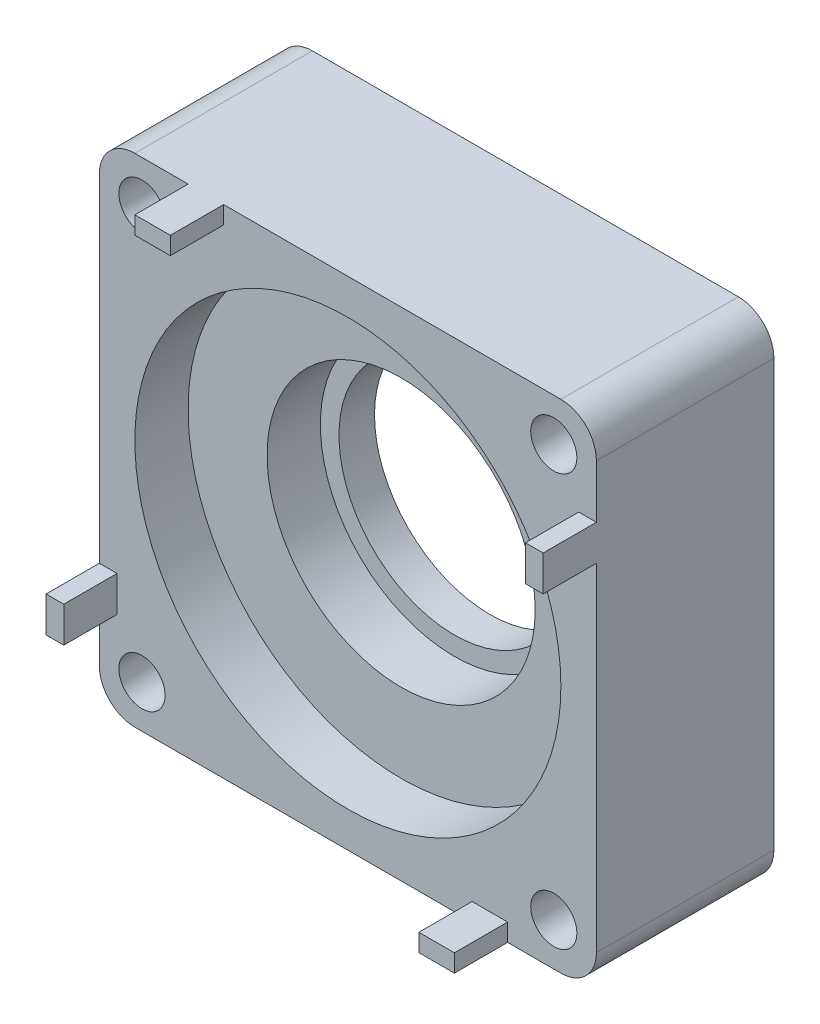
ISO-10303-21;
HEADER;
FILE_DESCRIPTION(('STEP AP214'),'2;1');
FILE_NAME('part.step','',(''),(''),'','','');
FILE_SCHEMA(('AUTOMOTIVE_DESIGN { 1 0 10303 214 1 1 1 1 }'));
ENDSEC;
DATA;
#1=APPLICATION_CONTEXT('core data for automotive mechanical design processes');
#2=APPLICATION_PROTOCOL_DEFINITION('international standard','automotive_design',2000,#1);
#3=PRODUCT_CONTEXT('',#1,'mechanical');
#4=PRODUCT('Part','Part','',(#3));
#5=PRODUCT_RELATED_PRODUCT_CATEGORY('part','',(#4));
#6=PRODUCT_DEFINITION_FORMATION('','',#4);
#7=PRODUCT_DEFINITION_CONTEXT('part definition',#1,'design');
#8=PRODUCT_DEFINITION('design','',#6,#7);
#9=PRODUCT_DEFINITION_SHAPE('','',#8);
#10=(LENGTH_UNIT() NAMED_UNIT(*) SI_UNIT(.MILLI.,.METRE.));
#11=(NAMED_UNIT(*) PLANE_ANGLE_UNIT() SI_UNIT($,.RADIAN.));
#12=(NAMED_UNIT(*) SI_UNIT($,.STERADIAN.) SOLID_ANGLE_UNIT());
#13=UNCERTAINTY_MEASURE_WITH_UNIT(LENGTH_MEASURE(1.E-05),#10,'distance_accuracy_value','');
#14=(GEOMETRIC_REPRESENTATION_CONTEXT(3) GLOBAL_UNCERTAINTY_ASSIGNED_CONTEXT((#13)) GLOBAL_UNIT_ASSIGNED_CONTEXT((#10,
#11,#12)) REPRESENTATION_CONTEXT('',''));
#15=CARTESIAN_POINT('',(0.,0.,0.));
#16=DIRECTION('',(0.,0.,1.));
#17=DIRECTION('',(1.,0.,0.));
#18=AXIS2_PLACEMENT_3D('',#15,#16,#17);
#19=CARTESIAN_POINT('',(0.,0.,-21.3546247918337));
#20=DIRECTION('',(0.,0.,1.));
#21=DIRECTION('',(1.,0.,0.));
#22=AXIS2_PLACEMENT_3D('',#19,#20,#21);
#23=CYLINDRICAL_SURFACE('',#22,7.55);
#24=CARTESIAN_POINT('',(0.,0.,4.));
#25=DIRECTION('',(0.,0.,1.));
#26=DIRECTION('',(1.,0.,0.));
#27=AXIS2_PLACEMENT_3D('',#24,#25,#26);
#28=CIRCLE('',#27,7.55);
#29=CARTESIAN_POINT('',(7.55,0.,4.));
#30=VERTEX_POINT('',#29);
#31=EDGE_CURVE('E325',#30,#30,#28,.F.);
#32=ORIENTED_EDGE('',*,*,#31,.T.);
#33=EDGE_LOOP('',(#32));
#34=FACE_BOUND('',#33,.T.);
#35=CARTESIAN_POINT('',(0.,0.,7.));
#36=DIRECTION('',(0.,0.,1.));
#37=DIRECTION('',(1.,0.,0.));
#38=AXIS2_PLACEMENT_3D('',#35,#36,#37);
#39=CIRCLE('',#38,7.55);
#40=CARTESIAN_POINT('',(7.55,0.,7.));
#41=VERTEX_POINT('',#40);
#42=EDGE_CURVE('E46',#41,#41,#39,.F.);
#43=ORIENTED_EDGE('',*,*,#42,.F.);
#44=EDGE_LOOP('',(#43));
#45=FACE_BOUND('',#44,.T.);
#46=ADVANCED_FACE('F42',(#34,#45),#23,.F.);
#47=CARTESIAN_POINT('',(0.,0.,10.));
#48=DIRECTION('',(0.,0.,1.));
#49=DIRECTION('',(1.,0.,0.));
#50=AXIS2_PLACEMENT_3D('',#47,#48,#49);
#51=PLANE('',#50);
#52=CARTESIAN_POINT('',(11.5999999999993,-11.6,10.));
#53=DIRECTION('',(0.,0.,1.));
#54=DIRECTION('',(1.,0.,0.));
#55=AXIS2_PLACEMENT_3D('',#52,#53,#54);
#56=CIRCLE('',#55,1.30000000000034);
#57=CARTESIAN_POINT('',(12.8999999999997,-11.6,10.));
#58=VERTEX_POINT('',#57);
#59=EDGE_CURVE('E420',#58,#58,#56,.T.);
#60=ORIENTED_EDGE('',*,*,#59,.F.);
#61=EDGE_LOOP('',(#60));
#62=FACE_BOUND('',#61,.T.);
#63=CARTESIAN_POINT('',(-11.6000000000007,-11.5999999999993,10.));
#64=DIRECTION('',(0.,0.,1.));
#65=DIRECTION('',(1.,0.,0.));
#66=AXIS2_PLACEMENT_3D('',#63,#64,#65);
#67=CIRCLE('',#66,1.30000000000092);
#68=CARTESIAN_POINT('',(-10.2999999999997,-11.5999999999993,10.));
#69=VERTEX_POINT('',#68);
#70=EDGE_CURVE('E423',#69,#69,#67,.T.);
#71=ORIENTED_EDGE('',*,*,#70,.F.);
#72=EDGE_LOOP('',(#71));
#73=FACE_BOUND('',#72,.T.);
#74=CARTESIAN_POINT('',(-11.6,11.6000000000007,10.));
#75=DIRECTION('',(0.,0.,1.));
#76=DIRECTION('',(1.,0.,0.));
#77=AXIS2_PLACEMENT_3D('',#74,#75,#76);
#78=CIRCLE('',#77,1.30000000000068);
#79=CARTESIAN_POINT('',(-10.2999999999993,11.6000000000007,10.));
#80=VERTEX_POINT('',#79);
#81=EDGE_CURVE('E426',#80,#80,#78,.T.);
#82=ORIENTED_EDGE('',*,*,#81,.F.);
#83=EDGE_LOOP('',(#82));
#84=FACE_BOUND('',#83,.T.);
#85=CARTESIAN_POINT('',(11.6,11.6,10.));
#86=DIRECTION('',(0.,0.,1.));
#87=DIRECTION('',(1.,0.,0.));
#88=AXIS2_PLACEMENT_3D('',#85,#86,#87);
#89=CIRCLE('',#88,1.3);
#90=CARTESIAN_POINT('',(12.9,11.6,10.));
#91=VERTEX_POINT('',#90);
#92=EDGE_CURVE('E429',#91,#91,#89,.T.);
#93=ORIENTED_EDGE('',*,*,#92,.F.);
#94=EDGE_LOOP('',(#93));
#95=FACE_BOUND('',#94,.T.);
#96=CARTESIAN_POINT('',(0.,0.,10.));
#97=DIRECTION('',(0.,0.,1.));
#98=DIRECTION('',(1.,0.,0.));
#99=AXIS2_PLACEMENT_3D('',#96,#97,#98);
#100=CIRCLE('',#99,12.);
#101=CARTESIAN_POINT('',(12.,0.,10.));
#102=VERTEX_POINT('',#101);
#103=EDGE_CURVE('E417',#102,#102,#100,.T.);
#104=ORIENTED_EDGE('',*,*,#103,.F.);
#105=EDGE_LOOP('',(#104));
#106=FACE_BOUND('',#105,.T.);
#107=DIRECTION('',(-1.,0.,0.));
#108=VECTOR('',#107,1.);
#109=CARTESIAN_POINT('',(6.99999999999986,-13.0046707835646,10.));
#110=LINE('',#109,#108);
#111=CARTESIAN_POINT('',(8.99999999999986,-13.0046707835646,10.));
#112=VERTEX_POINT('',#111);
#113=CARTESIAN_POINT('',(6.99999999999986,-13.0046707835646,10.));
#114=VERTEX_POINT('',#113);
#115=EDGE_CURVE('E58',#112,#114,#110,.T.);
#116=ORIENTED_EDGE('',*,*,#115,.F.);
#117=DIRECTION('',(0.,1.,0.));
#118=VECTOR('',#117,1.);
#119=CARTESIAN_POINT('',(8.99999999999985,-14.0000000000001,10.));
#120=LINE('',#119,#118);
#121=CARTESIAN_POINT('',(8.99999999999985,-14.0000000000001,10.));
#122=VERTEX_POINT('',#121);
#123=EDGE_CURVE('E411',#122,#112,#120,.T.);
#124=ORIENTED_EDGE('',*,*,#123,.F.);
#125=DIRECTION('',(1.,0.,0.));
#126=VECTOR('',#125,1.);
#127=CARTESIAN_POINT('',(-14.,-14.,10.));
#128=LINE('',#127,#126);
#129=CARTESIAN_POINT('',(12.,-14.,10.));
#130=VERTEX_POINT('',#129);
#131=EDGE_CURVE('E226',#122,#130,#128,.T.);
#132=ORIENTED_EDGE('',*,*,#131,.T.);
#133=CARTESIAN_POINT('',(12.,-12.,10.));
#134=DIRECTION('',(0.,0.,1.));
#135=DIRECTION('',(1.,0.,0.));
#136=AXIS2_PLACEMENT_3D('',#133,#134,#135);
#137=CIRCLE('',#136,2.);
#138=CARTESIAN_POINT('',(14.,-12.,10.));
#139=VERTEX_POINT('',#138);
#140=EDGE_CURVE('E381',#130,#139,#137,.T.);
#141=ORIENTED_EDGE('',*,*,#140,.T.);
#142=DIRECTION('',(0.,1.,0.));
#143=VECTOR('',#142,1.);
#144=CARTESIAN_POINT('',(14.,14.,10.));
#145=LINE('',#144,#143);
#146=CARTESIAN_POINT('',(14.,7.,10.));
#147=VERTEX_POINT('',#146);
#148=EDGE_CURVE('E329',#139,#147,#145,.T.);
#149=ORIENTED_EDGE('',*,*,#148,.T.);
#150=DIRECTION('',(1.,0.,0.));
#151=VECTOR('',#150,1.);
#152=CARTESIAN_POINT('',(14.,7.,10.));
#153=LINE('',#152,#151);
#154=CARTESIAN_POINT('',(13.0046707835645,7.,10.));
#155=VERTEX_POINT('',#154);
#156=EDGE_CURVE('E240',#155,#147,#153,.T.);
#157=ORIENTED_EDGE('',*,*,#156,.F.);
#158=DIRECTION('',(0.,-1.,0.));
#159=VECTOR('',#158,1.);
#160=CARTESIAN_POINT('',(13.0046707835645,7.,10.));
#161=LINE('',#160,#159);
#162=CARTESIAN_POINT('',(13.0046707835645,9.,10.));
#163=VERTEX_POINT('',#162);
#164=EDGE_CURVE('E230',#163,#155,#161,.T.);
#165=ORIENTED_EDGE('',*,*,#164,.F.);
#166=DIRECTION('',(-1.,0.,0.));
#167=VECTOR('',#166,1.);
#168=CARTESIAN_POINT('',(14.,9.,10.));
#169=LINE('',#168,#167);
#170=CARTESIAN_POINT('',(14.,9.,10.));
#171=VERTEX_POINT('',#170);
#172=EDGE_CURVE('E227',#171,#163,#169,.T.);
#173=ORIENTED_EDGE('',*,*,#172,.F.);
#174=CARTESIAN_POINT('',(14.,12.,10.));
#175=VERTEX_POINT('',#174);
#176=EDGE_CURVE('E332',#171,#175,#145,.T.);
#177=ORIENTED_EDGE('',*,*,#176,.T.);
#178=CARTESIAN_POINT('',(12.,12.,10.));
#179=DIRECTION('',(0.,0.,1.));
#180=DIRECTION('',(1.,0.,0.));
#181=AXIS2_PLACEMENT_3D('',#178,#179,#180);
#182=CIRCLE('',#181,2.);
#183=CARTESIAN_POINT('',(12.,14.,10.));
#184=VERTEX_POINT('',#183);
#185=EDGE_CURVE('E379',#175,#184,#182,.T.);
#186=ORIENTED_EDGE('',*,*,#185,.T.);
#187=DIRECTION('',(-1.,0.,0.));
#188=VECTOR('',#187,1.);
#189=CARTESIAN_POINT('',(-14.,14.,10.));
#190=LINE('',#189,#188);
#191=CARTESIAN_POINT('',(-6.99999999999995,14.,10.));
#192=VERTEX_POINT('',#191);
#193=EDGE_CURVE('E333',#184,#192,#190,.T.);
#194=ORIENTED_EDGE('',*,*,#193,.T.);
#195=DIRECTION('',(0.,1.,0.));
#196=VECTOR('',#195,1.);
#197=CARTESIAN_POINT('',(-6.99999999999995,14.,10.));
#198=LINE('',#197,#196);
#199=CARTESIAN_POINT('',(-6.99999999999996,13.0046707835646,10.));
#200=VERTEX_POINT('',#199);
#201=EDGE_CURVE('E267',#200,#192,#198,.T.);
#202=ORIENTED_EDGE('',*,*,#201,.F.);
#203=DIRECTION('',(1.,0.,0.));
#204=VECTOR('',#203,1.);
#205=CARTESIAN_POINT('',(-6.99999999999996,13.0046707835646,10.));
#206=LINE('',#205,#204);
#207=CARTESIAN_POINT('',(-8.99999999999995,13.0046707835646,10.));
#208=VERTEX_POINT('',#207);
#209=EDGE_CURVE('E275',#208,#200,#206,.T.);
#210=ORIENTED_EDGE('',*,*,#209,.F.);
#211=DIRECTION('',(0.,-1.,0.));
#212=VECTOR('',#211,1.);
#213=CARTESIAN_POINT('',(-8.99999999999995,14.,10.));
#214=LINE('',#213,#212);
#215=CARTESIAN_POINT('',(-8.99999999999995,14.,10.));
#216=VERTEX_POINT('',#215);
#217=EDGE_CURVE('E262',#216,#208,#214,.T.);
#218=ORIENTED_EDGE('',*,*,#217,.F.);
#219=CARTESIAN_POINT('',(-12.,14.,10.));
#220=VERTEX_POINT('',#219);
#221=EDGE_CURVE('E331',#216,#220,#190,.T.);
#222=ORIENTED_EDGE('',*,*,#221,.T.);
#223=CARTESIAN_POINT('',(-12.,12.,10.));
#224=DIRECTION('',(0.,0.,1.));
#225=DIRECTION('',(1.,0.,0.));
#226=AXIS2_PLACEMENT_3D('',#223,#224,#225);
#227=CIRCLE('',#226,2.);
#228=CARTESIAN_POINT('',(-14.,12.,10.));
#229=VERTEX_POINT('',#228);
#230=EDGE_CURVE('E377',#220,#229,#227,.T.);
#231=ORIENTED_EDGE('',*,*,#230,.T.);
#232=DIRECTION('',(0.,-1.,0.));
#233=VECTOR('',#232,1.);
#234=CARTESIAN_POINT('',(-14.,14.,10.));
#235=LINE('',#234,#233);
#236=CARTESIAN_POINT('',(-14.,-7.,10.));
#237=VERTEX_POINT('',#236);
#238=EDGE_CURVE('E337',#229,#237,#235,.T.);
#239=ORIENTED_EDGE('',*,*,#238,.T.);
#240=DIRECTION('',(-1.,0.,0.));
#241=VECTOR('',#240,1.);
#242=CARTESIAN_POINT('',(-14.,-7.,10.));
#243=LINE('',#242,#241);
#244=CARTESIAN_POINT('',(-13.0046707835645,-7.,10.));
#245=VERTEX_POINT('',#244);
#246=EDGE_CURVE('E293',#245,#237,#243,.T.);
#247=ORIENTED_EDGE('',*,*,#246,.F.);
#248=DIRECTION('',(0.,1.,0.));
#249=VECTOR('',#248,1.);
#250=CARTESIAN_POINT('',(-13.0046707835645,-7.,10.));
#251=LINE('',#250,#249);
#252=CARTESIAN_POINT('',(-13.0046707835645,-9.,10.));
#253=VERTEX_POINT('',#252);
#254=EDGE_CURVE('E302',#253,#245,#251,.T.);
#255=ORIENTED_EDGE('',*,*,#254,.F.);
#256=DIRECTION('',(1.,0.,0.));
#257=VECTOR('',#256,1.);
#258=CARTESIAN_POINT('',(-14.,-9.,10.));
#259=LINE('',#258,#257);
#260=CARTESIAN_POINT('',(-14.,-9.,10.));
#261=VERTEX_POINT('',#260);
#262=EDGE_CURVE('E288',#261,#253,#259,.T.);
#263=ORIENTED_EDGE('',*,*,#262,.F.);
#264=CARTESIAN_POINT('',(-14.,-12.,10.));
#265=VERTEX_POINT('',#264);
#266=EDGE_CURVE('E336',#261,#265,#235,.T.);
#267=ORIENTED_EDGE('',*,*,#266,.T.);
#268=CARTESIAN_POINT('',(-12.,-12.,10.));
#269=DIRECTION('',(0.,0.,1.));
#270=DIRECTION('',(1.,0.,0.));
#271=AXIS2_PLACEMENT_3D('',#268,#269,#270);
#272=CIRCLE('',#271,2.);
#273=CARTESIAN_POINT('',(-12.,-14.,10.));
#274=VERTEX_POINT('',#273);
#275=EDGE_CURVE('E375',#265,#274,#272,.T.);
#276=ORIENTED_EDGE('',*,*,#275,.T.);
#277=CARTESIAN_POINT('',(6.99999999999986,-14.,10.));
#278=VERTEX_POINT('',#277);
#279=EDGE_CURVE('E339',#274,#278,#128,.T.);
#280=ORIENTED_EDGE('',*,*,#279,.T.);
#281=DIRECTION('',(0.,-1.,0.));
#282=VECTOR('',#281,1.);
#283=CARTESIAN_POINT('',(6.99999999999985,-14.0000000000001,10.));
#284=LINE('',#283,#282);
#285=EDGE_CURVE('E63',#114,#278,#284,.T.);
#286=ORIENTED_EDGE('',*,*,#285,.F.);
#287=EDGE_LOOP('',(#116,#124,#132,#141,#149,#157,#165,#173,#177,#186,#194,#202,#210,#218,#222,
#231,#239,#247,#255,#263,#267,#276,#280,#286));
#288=FACE_BOUND('',#287,.T.);
#289=ADVANCED_FACE('F401',(#62,#73,#84,#95,#106,#288),#51,.T.);
#290=CARTESIAN_POINT('',(0.,0.,0.));
#291=DIRECTION('',(0.,0.,1.));
#292=DIRECTION('',(1.,0.,0.));
#293=AXIS2_PLACEMENT_3D('',#290,#291,#292);
#294=CYLINDRICAL_SURFACE('',#293,6.5);
#295=CARTESIAN_POINT('',(0.,0.,4.));
#296=DIRECTION('',(0.,0.,1.));
#297=DIRECTION('',(1.,0.,0.));
#298=AXIS2_PLACEMENT_3D('',#295,#296,#297);
#299=CIRCLE('',#298,6.5);
#300=CARTESIAN_POINT('',(6.5,0.,4.));
#301=VERTEX_POINT('',#300);
#302=EDGE_CURVE('E328',#301,#301,#299,.F.);
#303=ORIENTED_EDGE('',*,*,#302,.F.);
#304=EDGE_LOOP('',(#303));
#305=FACE_BOUND('',#304,.T.);
#306=CARTESIAN_POINT('',(0.,0.,2.));
#307=DIRECTION('',(0.,0.,-1.));
#308=DIRECTION('',(-1.,0.,0.));
#309=AXIS2_PLACEMENT_3D('',#306,#307,#308);
#310=CIRCLE('',#309,6.5);
#311=CARTESIAN_POINT('',(-6.5,0.,2.));
#312=VERTEX_POINT('',#311);
#313=EDGE_CURVE('E322',#312,#312,#310,.F.);
#314=ORIENTED_EDGE('',*,*,#313,.F.);
#315=EDGE_LOOP('',(#314));
#316=FACE_BOUND('',#315,.T.);
#317=ADVANCED_FACE('F531',(#305,#316),#294,.F.);
#318=CARTESIAN_POINT('',(14.,14.,10.));
#319=DIRECTION('',(-1.,0.,0.));
#320=DIRECTION('',(0.,0.,1.));
#321=AXIS2_PLACEMENT_3D('',#318,#319,#320);
#322=PLANE('',#321);
#323=ORIENTED_EDGE('',*,*,#148,.F.);
#324=DIRECTION('',(0.,0.,-1.));
#325=VECTOR('',#324,1.);
#326=CARTESIAN_POINT('',(14.,-12.,10.));
#327=LINE('',#326,#325);
#328=CARTESIAN_POINT('',(14.,-12.,0.));
#329=VERTEX_POINT('',#328);
#330=EDGE_CURVE('E359',#139,#329,#327,.T.);
#331=ORIENTED_EDGE('',*,*,#330,.T.);
#332=DIRECTION('',(0.,1.,0.));
#333=VECTOR('',#332,1.);
#334=CARTESIAN_POINT('',(14.,14.,0.));
#335=LINE('',#334,#333);
#336=CARTESIAN_POINT('',(14.,12.,0.));
#337=VERTEX_POINT('',#336);
#338=EDGE_CURVE('E342',#329,#337,#335,.T.);
#339=ORIENTED_EDGE('',*,*,#338,.T.);
#340=DIRECTION('',(0.,0.,-1.));
#341=VECTOR('',#340,1.);
#342=CARTESIAN_POINT('',(14.,12.,10.));
#343=LINE('',#342,#341);
#344=EDGE_CURVE('E341',#337,#175,#343,.F.);
#345=ORIENTED_EDGE('',*,*,#344,.T.);
#346=ORIENTED_EDGE('',*,*,#176,.F.);
#347=DIRECTION('',(0.,0.,-1.));
#348=VECTOR('',#347,1.);
#349=CARTESIAN_POINT('',(14.,9.,13.));
#350=LINE('',#349,#348);
#351=CARTESIAN_POINT('',(14.,9.,13.));
#352=VERTEX_POINT('',#351);
#353=EDGE_CURVE('E259',#352,#171,#350,.T.);
#354=ORIENTED_EDGE('',*,*,#353,.F.);
#355=DIRECTION('',(0.,1.,0.));
#356=VECTOR('',#355,1.);
#357=CARTESIAN_POINT('',(14.,7.,13.));
#358=LINE('',#357,#356);
#359=CARTESIAN_POINT('',(14.,7.,13.));
#360=VERTEX_POINT('',#359);
#361=EDGE_CURVE('E236',#360,#352,#358,.T.);
#362=ORIENTED_EDGE('',*,*,#361,.F.);
#363=DIRECTION('',(0.,0.,-1.));
#364=VECTOR('',#363,1.);
#365=CARTESIAN_POINT('',(14.,7.,13.));
#366=LINE('',#365,#364);
#367=EDGE_CURVE('E245',#360,#147,#366,.T.);
#368=ORIENTED_EDGE('',*,*,#367,.T.);
#369=EDGE_LOOP('',(#323,#331,#339,#345,#346,#354,#362,#368));
#370=FACE_BOUND('',#369,.T.);
#371=ADVANCED_FACE('F462',(#370),#322,.F.);
#372=CARTESIAN_POINT('',(-14.,14.,10.));
#373=DIRECTION('',(0.,-1.,0.));
#374=DIRECTION('',(0.,0.,-1.));
#375=AXIS2_PLACEMENT_3D('',#372,#373,#374);
#376=PLANE('',#375);
#377=ORIENTED_EDGE('',*,*,#193,.F.);
#378=DIRECTION('',(0.,0.,-1.));
#379=VECTOR('',#378,1.);
#380=CARTESIAN_POINT('',(12.,14.,10.));
#381=LINE('',#380,#379);
#382=CARTESIAN_POINT('',(12.,14.,0.));
#383=VERTEX_POINT('',#382);
#384=EDGE_CURVE('E386',#184,#383,#381,.T.);
#385=ORIENTED_EDGE('',*,*,#384,.T.);
#386=DIRECTION('',(-1.,0.,0.));
#387=VECTOR('',#386,1.);
#388=CARTESIAN_POINT('',(-14.,14.,0.));
#389=LINE('',#388,#387);
#390=CARTESIAN_POINT('',(-12.,14.,0.));
#391=VERTEX_POINT('',#390);
#392=EDGE_CURVE('E345',#383,#391,#389,.T.);
#393=ORIENTED_EDGE('',*,*,#392,.T.);
#394=DIRECTION('',(0.,0.,-1.));
#395=VECTOR('',#394,1.);
#396=CARTESIAN_POINT('',(-12.,14.,10.));
#397=LINE('',#396,#395);
#398=EDGE_CURVE('E383',#391,#220,#397,.F.);
#399=ORIENTED_EDGE('',*,*,#398,.T.);
#400=ORIENTED_EDGE('',*,*,#221,.F.);
#401=DIRECTION('',(0.,0.,-1.));
#402=VECTOR('',#401,1.);
#403=CARTESIAN_POINT('',(-8.99999999999995,14.,13.));
#404=LINE('',#403,#402);
#405=CARTESIAN_POINT('',(-8.99999999999995,14.,13.));
#406=VERTEX_POINT('',#405);
#407=EDGE_CURVE('E286',#406,#216,#404,.T.);
#408=ORIENTED_EDGE('',*,*,#407,.F.);
#409=DIRECTION('',(-1.,0.,0.));
#410=VECTOR('',#409,1.);
#411=CARTESIAN_POINT('',(-6.99999999999995,14.,13.));
#412=LINE('',#411,#410);
#413=CARTESIAN_POINT('',(-6.99999999999995,14.,13.));
#414=VERTEX_POINT('',#413);
#415=EDGE_CURVE('E263',#414,#406,#412,.T.);
#416=ORIENTED_EDGE('',*,*,#415,.F.);
#417=DIRECTION('',(0.,0.,-1.));
#418=VECTOR('',#417,1.);
#419=CARTESIAN_POINT('',(-6.99999999999995,14.,13.));
#420=LINE('',#419,#418);
#421=EDGE_CURVE('E273',#414,#192,#420,.T.);
#422=ORIENTED_EDGE('',*,*,#421,.T.);
#423=EDGE_LOOP('',(#377,#385,#393,#399,#400,#408,#416,#422));
#424=FACE_BOUND('',#423,.T.);
#425=ADVANCED_FACE('F472',(#424),#376,.F.);
#426=CARTESIAN_POINT('',(-14.,14.,10.));
#427=DIRECTION('',(1.,0.,0.));
#428=DIRECTION('',(0.,0.,-1.));
#429=AXIS2_PLACEMENT_3D('',#426,#427,#428);
#430=PLANE('',#429);
#431=ORIENTED_EDGE('',*,*,#238,.F.);
#432=DIRECTION('',(0.,0.,-1.));
#433=VECTOR('',#432,1.);
#434=CARTESIAN_POINT('',(-14.,12.,10.));
#435=LINE('',#434,#433);
#436=CARTESIAN_POINT('',(-14.,12.,0.));
#437=VERTEX_POINT('',#436);
#438=EDGE_CURVE('E13',#229,#437,#435,.T.);
#439=ORIENTED_EDGE('',*,*,#438,.T.);
#440=DIRECTION('',(0.,-1.,0.));
#441=VECTOR('',#440,1.);
#442=CARTESIAN_POINT('',(-14.,14.,0.));
#443=LINE('',#442,#441);
#444=CARTESIAN_POINT('',(-14.,-12.,0.));
#445=VERTEX_POINT('',#444);
#446=EDGE_CURVE('E348',#437,#445,#443,.T.);
#447=ORIENTED_EDGE('',*,*,#446,.T.);
#448=DIRECTION('',(0.,0.,-1.));
#449=VECTOR('',#448,1.);
#450=CARTESIAN_POINT('',(-14.,-12.,10.));
#451=LINE('',#450,#449);
#452=EDGE_CURVE('E51',#445,#265,#451,.F.);
#453=ORIENTED_EDGE('',*,*,#452,.T.);
#454=ORIENTED_EDGE('',*,*,#266,.F.);
#455=DIRECTION('',(0.,0.,-1.));
#456=VECTOR('',#455,1.);
#457=CARTESIAN_POINT('',(-14.,-9.,13.));
#458=LINE('',#457,#456);
#459=CARTESIAN_POINT('',(-14.,-9.,13.));
#460=VERTEX_POINT('',#459);
#461=EDGE_CURVE('E315',#460,#261,#458,.T.);
#462=ORIENTED_EDGE('',*,*,#461,.F.);
#463=DIRECTION('',(0.,-1.,0.));
#464=VECTOR('',#463,1.);
#465=CARTESIAN_POINT('',(-14.,-7.,13.));
#466=LINE('',#465,#464);
#467=CARTESIAN_POINT('',(-14.,-7.,13.));
#468=VERTEX_POINT('',#467);
#469=EDGE_CURVE('E289',#468,#460,#466,.T.);
#470=ORIENTED_EDGE('',*,*,#469,.F.);
#471=DIRECTION('',(0.,0.,-1.));
#472=VECTOR('',#471,1.);
#473=CARTESIAN_POINT('',(-14.,-7.,13.));
#474=LINE('',#473,#472);
#475=EDGE_CURVE('E299',#468,#237,#474,.T.);
#476=ORIENTED_EDGE('',*,*,#475,.T.);
#477=EDGE_LOOP('',(#431,#439,#447,#453,#454,#462,#470,#476));
#478=FACE_BOUND('',#477,.T.);
#479=ADVANCED_FACE('F395',(#478),#430,.F.);
#480=CARTESIAN_POINT('',(-14.,-14.,10.));
#481=DIRECTION('',(0.,1.,0.));
#482=DIRECTION('',(0.,0.,1.));
#483=AXIS2_PLACEMENT_3D('',#480,#481,#482);
#484=PLANE('',#483);
#485=DIRECTION('',(1.,0.,0.));
#486=VECTOR('',#485,1.);
#487=CARTESIAN_POINT('',(-14.,-14.,0.));
#488=LINE('',#487,#486);
#489=CARTESIAN_POINT('',(-12.,-14.,0.));
#490=VERTEX_POINT('',#489);
#491=CARTESIAN_POINT('',(12.,-14.,0.));
#492=VERTEX_POINT('',#491);
#493=EDGE_CURVE('E351',#490,#492,#488,.T.);
#494=ORIENTED_EDGE('',*,*,#493,.T.);
#495=DIRECTION('',(0.,0.,-1.));
#496=VECTOR('',#495,1.);
#497=CARTESIAN_POINT('',(12.,-14.,10.));
#498=LINE('',#497,#496);
#499=EDGE_CURVE('E373',#492,#130,#498,.F.);
#500=ORIENTED_EDGE('',*,*,#499,.T.);
#501=ORIENTED_EDGE('',*,*,#131,.F.);
#502=DIRECTION('',(0.,0.,-1.));
#503=VECTOR('',#502,1.);
#504=CARTESIAN_POINT('',(8.99999999999985,-14.0000000000001,13.));
#505=LINE('',#504,#503);
#506=CARTESIAN_POINT('',(8.99999999999985,-14.0000000000001,13.));
#507=VERTEX_POINT('',#506);
#508=EDGE_CURVE('E207',#507,#122,#505,.T.);
#509=ORIENTED_EDGE('',*,*,#508,.F.);
#510=DIRECTION('',(1.,0.,0.));
#511=VECTOR('',#510,1.);
#512=CARTESIAN_POINT('',(6.99999999999985,-14.0000000000001,13.));
#513=LINE('',#512,#511);
#514=CARTESIAN_POINT('',(6.99999999999985,-14.0000000000001,13.));
#515=VERTEX_POINT('',#514);
#516=EDGE_CURVE('E213',#515,#507,#513,.T.);
#517=ORIENTED_EDGE('',*,*,#516,.F.);
#518=DIRECTION('',(0.,0.,-1.));
#519=VECTOR('',#518,1.);
#520=CARTESIAN_POINT('',(6.99999999999985,-14.0000000000001,13.));
#521=LINE('',#520,#519);
#522=EDGE_CURVE('E403',#515,#278,#521,.T.);
#523=ORIENTED_EDGE('',*,*,#522,.T.);
#524=ORIENTED_EDGE('',*,*,#279,.F.);
#525=DIRECTION('',(0.,0.,-1.));
#526=VECTOR('',#525,1.);
#527=CARTESIAN_POINT('',(-12.,-14.,10.));
#528=LINE('',#527,#526);
#529=EDGE_CURVE('E370',#274,#490,#528,.T.);
#530=ORIENTED_EDGE('',*,*,#529,.T.);
#531=EDGE_LOOP('',(#494,#500,#501,#509,#517,#523,#524,#530));
#532=FACE_BOUND('',#531,.T.);
#533=ADVANCED_FACE('F224',(#532),#484,.F.);
#534=CARTESIAN_POINT('',(0.,0.,0.));
#535=DIRECTION('',(0.,0.,1.));
#536=DIRECTION('',(1.,0.,0.));
#537=AXIS2_PLACEMENT_3D('',#534,#535,#536);
#538=PLANE('',#537);
#539=CARTESIAN_POINT('',(11.5999999999993,-11.6,0.));
#540=DIRECTION('',(0.,0.,-1.));
#541=DIRECTION('',(-1.,0.,0.));
#542=AXIS2_PLACEMENT_3D('',#539,#540,#541);
#543=CIRCLE('',#542,1.30000000000034);
#544=CARTESIAN_POINT('',(10.299999999999,-11.6,0.));
#545=VERTEX_POINT('',#544);
#546=EDGE_CURVE('E436',#545,#545,#543,.T.);
#547=ORIENTED_EDGE('',*,*,#546,.F.);
#548=EDGE_LOOP('',(#547));
#549=FACE_BOUND('',#548,.T.);
#550=CARTESIAN_POINT('',(-11.6000000000007,-11.5999999999993,0.));
#551=DIRECTION('',(0.,0.,-1.));
#552=DIRECTION('',(-1.,0.,0.));
#553=AXIS2_PLACEMENT_3D('',#550,#551,#552);
#554=CIRCLE('',#553,1.30000000000092);
#555=CARTESIAN_POINT('',(-12.9000000000016,-11.5999999999993,0.));
#556=VERTEX_POINT('',#555);
#557=EDGE_CURVE('E439',#556,#556,#554,.T.);
#558=ORIENTED_EDGE('',*,*,#557,.F.);
#559=EDGE_LOOP('',(#558));
#560=FACE_BOUND('',#559,.T.);
#561=CARTESIAN_POINT('',(-11.6,11.6000000000007,0.));
#562=DIRECTION('',(0.,0.,-1.));
#563=DIRECTION('',(-1.,0.,0.));
#564=AXIS2_PLACEMENT_3D('',#561,#562,#563);
#565=CIRCLE('',#564,1.30000000000068);
#566=CARTESIAN_POINT('',(-12.9000000000007,11.6000000000007,0.));
#567=VERTEX_POINT('',#566);
#568=EDGE_CURVE('E435',#567,#567,#565,.T.);
#569=ORIENTED_EDGE('',*,*,#568,.F.);
#570=EDGE_LOOP('',(#569));
#571=FACE_BOUND('',#570,.T.);
#572=CARTESIAN_POINT('',(11.6,11.6,0.));
#573=DIRECTION('',(0.,0.,-1.));
#574=DIRECTION('',(-1.,0.,0.));
#575=AXIS2_PLACEMENT_3D('',#572,#573,#574);
#576=CIRCLE('',#575,1.3);
#577=CARTESIAN_POINT('',(10.3,11.6,0.));
#578=VERTEX_POINT('',#577);
#579=EDGE_CURVE('E432',#578,#578,#576,.T.);
#580=ORIENTED_EDGE('',*,*,#579,.F.);
#581=EDGE_LOOP('',(#580));
#582=FACE_BOUND('',#581,.T.);
#583=CARTESIAN_POINT('',(0.,0.,0.));
#584=DIRECTION('',(0.,0.,-1.));
#585=DIRECTION('',(-1.,0.,0.));
#586=AXIS2_PLACEMENT_3D('',#583,#584,#585);
#587=CIRCLE('',#586,11.05);
#588=CARTESIAN_POINT('',(-11.05,0.,0.));
#589=VERTEX_POINT('',#588);
#590=EDGE_CURVE('E318',#589,#589,#587,.T.);
#591=ORIENTED_EDGE('',*,*,#590,.F.);
#592=EDGE_LOOP('',(#591));
#593=FACE_BOUND('',#592,.T.);
#594=ORIENTED_EDGE('',*,*,#338,.F.);
#595=CARTESIAN_POINT('',(12.,-12.,0.));
#596=DIRECTION('',(0.,0.,1.));
#597=DIRECTION('',(1.,0.,0.));
#598=AXIS2_PLACEMENT_3D('',#595,#596,#597);
#599=CIRCLE('',#598,2.);
#600=EDGE_CURVE('E368',#329,#492,#599,.F.);
#601=ORIENTED_EDGE('',*,*,#600,.T.);
#602=ORIENTED_EDGE('',*,*,#493,.F.);
#603=CARTESIAN_POINT('',(-12.,-12.,0.));
#604=DIRECTION('',(0.,0.,1.));
#605=DIRECTION('',(1.,0.,0.));
#606=AXIS2_PLACEMENT_3D('',#603,#604,#605);
#607=CIRCLE('',#606,2.);
#608=EDGE_CURVE('E362',#490,#445,#607,.F.);
#609=ORIENTED_EDGE('',*,*,#608,.T.);
#610=ORIENTED_EDGE('',*,*,#446,.F.);
#611=CARTESIAN_POINT('',(-12.,12.,0.));
#612=DIRECTION('',(0.,0.,1.));
#613=DIRECTION('',(1.,0.,0.));
#614=AXIS2_PLACEMENT_3D('',#611,#612,#613);
#615=CIRCLE('',#614,2.);
#616=EDGE_CURVE('E364',#437,#391,#615,.F.);
#617=ORIENTED_EDGE('',*,*,#616,.T.);
#618=ORIENTED_EDGE('',*,*,#392,.F.);
#619=CARTESIAN_POINT('',(12.,12.,0.));
#620=DIRECTION('',(0.,0.,1.));
#621=DIRECTION('',(1.,0.,0.));
#622=AXIS2_PLACEMENT_3D('',#619,#620,#621);
#623=CIRCLE('',#622,2.);
#624=EDGE_CURVE('E366',#383,#337,#623,.F.);
#625=ORIENTED_EDGE('',*,*,#624,.T.);
#626=EDGE_LOOP('',(#594,#601,#602,#609,#610,#617,#618,#625));
#627=FACE_BOUND('',#626,.T.);
#628=ADVANCED_FACE('F447',(#549,#560,#571,#582,#593,#627),#538,.F.);
#629=CARTESIAN_POINT('',(0.,0.,4.));
#630=DIRECTION('',(0.,0.,1.));
#631=DIRECTION('',(1.,0.,0.));
#632=AXIS2_PLACEMENT_3D('',#629,#630,#631);
#633=PLANE('',#632);
#634=ORIENTED_EDGE('',*,*,#31,.F.);
#635=EDGE_LOOP('',(#634));
#636=FACE_BOUND('',#635,.T.);
#637=ORIENTED_EDGE('',*,*,#302,.T.);
#638=EDGE_LOOP('',(#637));
#639=FACE_BOUND('',#638,.T.);
#640=ADVANCED_FACE('F450',(#636,#639),#633,.T.);
#641=CARTESIAN_POINT('',(0.,0.,2.));
#642=DIRECTION('',(0.,0.,-1.));
#643=DIRECTION('',(-1.,0.,0.));
#644=AXIS2_PLACEMENT_3D('',#641,#642,#643);
#645=PLANE('',#644);
#646=CARTESIAN_POINT('',(0.,0.,2.));
#647=DIRECTION('',(0.,0.,-1.));
#648=DIRECTION('',(-1.,0.,0.));
#649=AXIS2_PLACEMENT_3D('',#646,#647,#648);
#650=CIRCLE('',#649,11.05);
#651=CARTESIAN_POINT('',(-11.05,0.,2.));
#652=VERTEX_POINT('',#651);
#653=EDGE_CURVE('E319',#652,#652,#650,.T.);
#654=ORIENTED_EDGE('',*,*,#653,.T.);
#655=EDGE_LOOP('',(#654));
#656=FACE_BOUND('',#655,.T.);
#657=ORIENTED_EDGE('',*,*,#313,.T.);
#658=EDGE_LOOP('',(#657));
#659=FACE_BOUND('',#658,.T.);
#660=ADVANCED_FACE('F572',(#656,#659),#645,.T.);
#661=CARTESIAN_POINT('',(0.,0.,2.));
#662=DIRECTION('',(0.,0.,-1.));
#663=DIRECTION('',(-1.,0.,0.));
#664=AXIS2_PLACEMENT_3D('',#661,#662,#663);
#665=CYLINDRICAL_SURFACE('',#664,11.05);
#666=ORIENTED_EDGE('',*,*,#653,.F.);
#667=EDGE_LOOP('',(#666));
#668=FACE_BOUND('',#667,.T.);
#669=ORIENTED_EDGE('',*,*,#590,.T.);
#670=EDGE_LOOP('',(#669));
#671=FACE_BOUND('',#670,.T.);
#672=ADVANCED_FACE('F551',(#668,#671),#665,.F.);
#673=CARTESIAN_POINT('',(12.,-12.,10.));
#674=DIRECTION('',(0.,0.,-1.));
#675=DIRECTION('',(-1.,0.,0.));
#676=AXIS2_PLACEMENT_3D('',#673,#674,#675);
#677=CYLINDRICAL_SURFACE('',#676,2.);
#678=ORIENTED_EDGE('',*,*,#140,.F.);
#679=ORIENTED_EDGE('',*,*,#499,.F.);
#680=ORIENTED_EDGE('',*,*,#600,.F.);
#681=ORIENTED_EDGE('',*,*,#330,.F.);
#682=EDGE_LOOP('',(#678,#679,#680,#681));
#683=FACE_BOUND('',#682,.T.);
#684=ADVANCED_FACE('F499',(#683),#677,.T.);
#685=CARTESIAN_POINT('',(12.,12.,10.));
#686=DIRECTION('',(0.,0.,-1.));
#687=DIRECTION('',(-1.,0.,0.));
#688=AXIS2_PLACEMENT_3D('',#685,#686,#687);
#689=CYLINDRICAL_SURFACE('',#688,2.);
#690=ORIENTED_EDGE('',*,*,#185,.F.);
#691=ORIENTED_EDGE('',*,*,#344,.F.);
#692=ORIENTED_EDGE('',*,*,#624,.F.);
#693=ORIENTED_EDGE('',*,*,#384,.F.);
#694=EDGE_LOOP('',(#690,#691,#692,#693));
#695=FACE_BOUND('',#694,.T.);
#696=ADVANCED_FACE('F466',(#695),#689,.T.);
#697=CARTESIAN_POINT('',(-12.,12.,10.));
#698=DIRECTION('',(0.,0.,-1.));
#699=DIRECTION('',(-1.,0.,0.));
#700=AXIS2_PLACEMENT_3D('',#697,#698,#699);
#701=CYLINDRICAL_SURFACE('',#700,2.);
#702=ORIENTED_EDGE('',*,*,#230,.F.);
#703=ORIENTED_EDGE('',*,*,#398,.F.);
#704=ORIENTED_EDGE('',*,*,#616,.F.);
#705=ORIENTED_EDGE('',*,*,#438,.F.);
#706=EDGE_LOOP('',(#702,#703,#704,#705));
#707=FACE_BOUND('',#706,.T.);
#708=ADVANCED_FACE('F495',(#707),#701,.T.);
#709=CARTESIAN_POINT('',(-12.,-12.,10.));
#710=DIRECTION('',(0.,0.,-1.));
#711=DIRECTION('',(-1.,0.,0.));
#712=AXIS2_PLACEMENT_3D('',#709,#710,#711);
#713=CYLINDRICAL_SURFACE('',#712,2.);
#714=ORIENTED_EDGE('',*,*,#275,.F.);
#715=ORIENTED_EDGE('',*,*,#452,.F.);
#716=ORIENTED_EDGE('',*,*,#608,.F.);
#717=ORIENTED_EDGE('',*,*,#529,.F.);
#718=EDGE_LOOP('',(#714,#715,#716,#717));
#719=FACE_BOUND('',#718,.T.);
#720=ADVANCED_FACE('F44',(#719),#713,.T.);
#721=CARTESIAN_POINT('',(-14.,-9.,13.));
#722=DIRECTION('',(0.,1.,0.));
#723=DIRECTION('',(-1.,0.,0.));
#724=AXIS2_PLACEMENT_3D('',#721,#722,#723);
#725=PLANE('',#724);
#726=ORIENTED_EDGE('',*,*,#262,.T.);
#727=DIRECTION('',(0.,0.,-1.));
#728=VECTOR('',#727,1.);
#729=CARTESIAN_POINT('',(-13.0046707835645,-9.,13.));
#730=LINE('',#729,#728);
#731=CARTESIAN_POINT('',(-13.0046707835645,-9.,13.));
#732=VERTEX_POINT('',#731);
#733=EDGE_CURVE('E312',#732,#253,#730,.T.);
#734=ORIENTED_EDGE('',*,*,#733,.F.);
#735=DIRECTION('',(1.,0.,0.));
#736=VECTOR('',#735,1.);
#737=CARTESIAN_POINT('',(-14.,-9.,13.));
#738=LINE('',#737,#736);
#739=EDGE_CURVE('E292',#460,#732,#738,.T.);
#740=ORIENTED_EDGE('',*,*,#739,.F.);
#741=ORIENTED_EDGE('',*,*,#461,.T.);
#742=EDGE_LOOP('',(#726,#734,#740,#741));
#743=FACE_BOUND('',#742,.T.);
#744=ADVANCED_FACE('F557',(#743),#725,.F.);
#745=CARTESIAN_POINT('',(-13.0046707835645,-7.,13.));
#746=DIRECTION('',(-1.,0.,0.));
#747=DIRECTION('',(0.,-1.,0.));
#748=AXIS2_PLACEMENT_3D('',#745,#746,#747);
#749=PLANE('',#748);
#750=ORIENTED_EDGE('',*,*,#254,.T.);
#751=DIRECTION('',(0.,0.,-1.));
#752=VECTOR('',#751,1.);
#753=CARTESIAN_POINT('',(-13.0046707835645,-7.,13.));
#754=LINE('',#753,#752);
#755=CARTESIAN_POINT('',(-13.0046707835645,-7.,13.));
#756=VERTEX_POINT('',#755);
#757=EDGE_CURVE('E309',#756,#245,#754,.T.);
#758=ORIENTED_EDGE('',*,*,#757,.F.);
#759=DIRECTION('',(0.,1.,0.));
#760=VECTOR('',#759,1.);
#761=CARTESIAN_POINT('',(-13.0046707835645,-7.,13.));
#762=LINE('',#761,#760);
#763=EDGE_CURVE('E295',#732,#756,#762,.T.);
#764=ORIENTED_EDGE('',*,*,#763,.F.);
#765=ORIENTED_EDGE('',*,*,#733,.T.);
#766=EDGE_LOOP('',(#750,#758,#764,#765));
#767=FACE_BOUND('',#766,.T.);
#768=ADVANCED_FACE('F561',(#767),#749,.F.);
#769=CARTESIAN_POINT('',(-14.,-7.,13.));
#770=DIRECTION('',(0.,-1.,0.));
#771=DIRECTION('',(1.,0.,0.));
#772=AXIS2_PLACEMENT_3D('',#769,#770,#771);
#773=PLANE('',#772);
#774=ORIENTED_EDGE('',*,*,#246,.T.);
#775=ORIENTED_EDGE('',*,*,#475,.F.);
#776=DIRECTION('',(-1.,0.,0.));
#777=VECTOR('',#776,1.);
#778=CARTESIAN_POINT('',(-14.,-7.,13.));
#779=LINE('',#778,#777);
#780=EDGE_CURVE('E297',#756,#468,#779,.T.);
#781=ORIENTED_EDGE('',*,*,#780,.F.);
#782=ORIENTED_EDGE('',*,*,#757,.T.);
#783=EDGE_LOOP('',(#774,#775,#781,#782));
#784=FACE_BOUND('',#783,.T.);
#785=ADVANCED_FACE('F567',(#784),#773,.F.);
#786=CARTESIAN_POINT('',(0.,0.,13.));
#787=DIRECTION('',(0.,0.,1.));
#788=DIRECTION('',(1.,0.,0.));
#789=AXIS2_PLACEMENT_3D('',#786,#787,#788);
#790=PLANE('',#789);
#791=ORIENTED_EDGE('',*,*,#469,.T.);
#792=ORIENTED_EDGE('',*,*,#739,.T.);
#793=ORIENTED_EDGE('',*,*,#763,.T.);
#794=ORIENTED_EDGE('',*,*,#780,.T.);
#795=EDGE_LOOP('',(#791,#792,#793,#794));
#796=FACE_BOUND('',#795,.T.);
#797=ADVANCED_FACE('F634',(#796),#790,.T.);
#798=CARTESIAN_POINT('',(-8.99999999999995,14.,13.));
#799=DIRECTION('',(1.,0.,0.));
#800=DIRECTION('',(0.,1.,0.));
#801=AXIS2_PLACEMENT_3D('',#798,#799,#800);
#802=PLANE('',#801);
#803=ORIENTED_EDGE('',*,*,#217,.T.);
#804=DIRECTION('',(0.,0.,-1.));
#805=VECTOR('',#804,1.);
#806=CARTESIAN_POINT('',(-8.99999999999995,13.0046707835646,13.));
#807=LINE('',#806,#805);
#808=CARTESIAN_POINT('',(-8.99999999999995,13.0046707835646,13.));
#809=VERTEX_POINT('',#808);
#810=EDGE_CURVE('E283',#809,#208,#807,.T.);
#811=ORIENTED_EDGE('',*,*,#810,.F.);
#812=DIRECTION('',(0.,-1.,0.));
#813=VECTOR('',#812,1.);
#814=CARTESIAN_POINT('',(-8.99999999999995,14.,13.));
#815=LINE('',#814,#813);
#816=EDGE_CURVE('E266',#406,#809,#815,.T.);
#817=ORIENTED_EDGE('',*,*,#816,.F.);
#818=ORIENTED_EDGE('',*,*,#407,.T.);
#819=EDGE_LOOP('',(#803,#811,#817,#818));
#820=FACE_BOUND('',#819,.T.);
#821=ADVANCED_FACE('F488',(#820),#802,.F.);
#822=CARTESIAN_POINT('',(-6.99999999999996,13.0046707835646,13.));
#823=DIRECTION('',(0.,1.,0.));
#824=DIRECTION('',(-1.,0.,0.));
#825=AXIS2_PLACEMENT_3D('',#822,#823,#824);
#826=PLANE('',#825);
#827=ORIENTED_EDGE('',*,*,#209,.T.);
#828=DIRECTION('',(0.,0.,-1.));
#829=VECTOR('',#828,1.);
#830=CARTESIAN_POINT('',(-6.99999999999996,13.0046707835646,13.));
#831=LINE('',#830,#829);
#832=CARTESIAN_POINT('',(-6.99999999999996,13.0046707835646,13.));
#833=VERTEX_POINT('',#832);
#834=EDGE_CURVE('E281',#833,#200,#831,.T.);
#835=ORIENTED_EDGE('',*,*,#834,.F.);
#836=DIRECTION('',(1.,0.,0.));
#837=VECTOR('',#836,1.);
#838=CARTESIAN_POINT('',(-6.99999999999996,13.0046707835646,13.));
#839=LINE('',#838,#837);
#840=EDGE_CURVE('E269',#809,#833,#839,.T.);
#841=ORIENTED_EDGE('',*,*,#840,.F.);
#842=ORIENTED_EDGE('',*,*,#810,.T.);
#843=EDGE_LOOP('',(#827,#835,#841,#842));
#844=FACE_BOUND('',#843,.T.);
#845=ADVANCED_FACE('F484',(#844),#826,.F.);
#846=CARTESIAN_POINT('',(-6.99999999999995,14.,13.));
#847=DIRECTION('',(-1.,0.,0.));
#848=DIRECTION('',(0.,-1.,0.));
#849=AXIS2_PLACEMENT_3D('',#846,#847,#848);
#850=PLANE('',#849);
#851=ORIENTED_EDGE('',*,*,#201,.T.);
#852=ORIENTED_EDGE('',*,*,#421,.F.);
#853=DIRECTION('',(0.,1.,0.));
#854=VECTOR('',#853,1.);
#855=CARTESIAN_POINT('',(-6.99999999999995,14.,13.));
#856=LINE('',#855,#854);
#857=EDGE_CURVE('E271',#833,#414,#856,.T.);
#858=ORIENTED_EDGE('',*,*,#857,.F.);
#859=ORIENTED_EDGE('',*,*,#834,.T.);
#860=EDGE_LOOP('',(#851,#852,#858,#859));
#861=FACE_BOUND('',#860,.T.);
#862=ADVANCED_FACE('F478',(#861),#850,.F.);
#863=CARTESIAN_POINT('',(0.,0.,13.));
#864=DIRECTION('',(0.,0.,1.));
#865=DIRECTION('',(0.,-1.,0.));
#866=AXIS2_PLACEMENT_3D('',#863,#864,#865);
#867=PLANE('',#866);
#868=ORIENTED_EDGE('',*,*,#415,.T.);
#869=ORIENTED_EDGE('',*,*,#816,.T.);
#870=ORIENTED_EDGE('',*,*,#840,.T.);
#871=ORIENTED_EDGE('',*,*,#857,.T.);
#872=EDGE_LOOP('',(#868,#869,#870,#871));
#873=FACE_BOUND('',#872,.T.);
#874=ADVANCED_FACE('F695',(#873),#867,.T.);
#875=CARTESIAN_POINT('',(14.,9.,13.));
#876=DIRECTION('',(0.,-1.,0.));
#877=DIRECTION('',(1.,0.,0.));
#878=AXIS2_PLACEMENT_3D('',#875,#876,#877);
#879=PLANE('',#878);
#880=ORIENTED_EDGE('',*,*,#172,.T.);
#881=DIRECTION('',(0.,0.,-1.));
#882=VECTOR('',#881,1.);
#883=CARTESIAN_POINT('',(13.0046707835645,9.,13.));
#884=LINE('',#883,#882);
#885=CARTESIAN_POINT('',(13.0046707835645,9.,13.));
#886=VERTEX_POINT('',#885);
#887=EDGE_CURVE('E256',#886,#163,#884,.T.);
#888=ORIENTED_EDGE('',*,*,#887,.F.);
#889=DIRECTION('',(-1.,0.,0.));
#890=VECTOR('',#889,1.);
#891=CARTESIAN_POINT('',(14.,9.,13.));
#892=LINE('',#891,#890);
#893=EDGE_CURVE('E239',#352,#886,#892,.T.);
#894=ORIENTED_EDGE('',*,*,#893,.F.);
#895=ORIENTED_EDGE('',*,*,#353,.T.);
#896=EDGE_LOOP('',(#880,#888,#894,#895));
#897=FACE_BOUND('',#896,.T.);
#898=ADVANCED_FACE('F512',(#897),#879,.F.);
#899=CARTESIAN_POINT('',(13.0046707835645,7.,13.));
#900=DIRECTION('',(1.,0.,0.));
#901=DIRECTION('',(0.,1.,0.));
#902=AXIS2_PLACEMENT_3D('',#899,#900,#901);
#903=PLANE('',#902);
#904=ORIENTED_EDGE('',*,*,#164,.T.);
#905=DIRECTION('',(0.,0.,-1.));
#906=VECTOR('',#905,1.);
#907=CARTESIAN_POINT('',(13.0046707835645,7.,13.));
#908=LINE('',#907,#906);
#909=CARTESIAN_POINT('',(13.0046707835645,7.,13.));
#910=VERTEX_POINT('',#909);
#911=EDGE_CURVE('E253',#910,#155,#908,.T.);
#912=ORIENTED_EDGE('',*,*,#911,.F.);
#913=DIRECTION('',(0.,-1.,0.));
#914=VECTOR('',#913,1.);
#915=CARTESIAN_POINT('',(13.0046707835645,7.,13.));
#916=LINE('',#915,#914);
#917=EDGE_CURVE('E242',#886,#910,#916,.T.);
#918=ORIENTED_EDGE('',*,*,#917,.F.);
#919=ORIENTED_EDGE('',*,*,#887,.T.);
#920=EDGE_LOOP('',(#904,#912,#918,#919));
#921=FACE_BOUND('',#920,.T.);
#922=ADVANCED_FACE('F508',(#921),#903,.F.);
#923=CARTESIAN_POINT('',(14.,7.,13.));
#924=DIRECTION('',(0.,1.,0.));
#925=DIRECTION('',(-1.,0.,0.));
#926=AXIS2_PLACEMENT_3D('',#923,#924,#925);
#927=PLANE('',#926);
#928=ORIENTED_EDGE('',*,*,#156,.T.);
#929=ORIENTED_EDGE('',*,*,#367,.F.);
#930=DIRECTION('',(1.,0.,0.));
#931=VECTOR('',#930,1.);
#932=CARTESIAN_POINT('',(14.,7.,13.));
#933=LINE('',#932,#931);
#934=EDGE_CURVE('E244',#910,#360,#933,.T.);
#935=ORIENTED_EDGE('',*,*,#934,.F.);
#936=ORIENTED_EDGE('',*,*,#911,.T.);
#937=EDGE_LOOP('',(#928,#929,#935,#936));
#938=FACE_BOUND('',#937,.T.);
#939=ADVANCED_FACE('F505',(#938),#927,.F.);
#940=CARTESIAN_POINT('',(0.,0.,13.));
#941=DIRECTION('',(0.,0.,1.));
#942=DIRECTION('',(-1.,0.,0.));
#943=AXIS2_PLACEMENT_3D('',#940,#941,#942);
#944=PLANE('',#943);
#945=ORIENTED_EDGE('',*,*,#361,.T.);
#946=ORIENTED_EDGE('',*,*,#893,.T.);
#947=ORIENTED_EDGE('',*,*,#917,.T.);
#948=ORIENTED_EDGE('',*,*,#934,.T.);
#949=EDGE_LOOP('',(#945,#946,#947,#948));
#950=FACE_BOUND('',#949,.T.);
#951=ADVANCED_FACE('F514',(#950),#944,.T.);
#952=CARTESIAN_POINT('',(8.99999999999985,-14.0000000000001,13.));
#953=DIRECTION('',(-1.,0.,0.));
#954=DIRECTION('',(0.,-1.,0.));
#955=AXIS2_PLACEMENT_3D('',#952,#953,#954);
#956=PLANE('',#955);
#957=ORIENTED_EDGE('',*,*,#123,.T.);
#958=DIRECTION('',(0.,0.,-1.));
#959=VECTOR('',#958,1.);
#960=CARTESIAN_POINT('',(8.99999999999986,-13.0046707835646,13.));
#961=LINE('',#960,#959);
#962=CARTESIAN_POINT('',(8.99999999999986,-13.0046707835646,13.));
#963=VERTEX_POINT('',#962);
#964=EDGE_CURVE('E209',#963,#112,#961,.T.);
#965=ORIENTED_EDGE('',*,*,#964,.F.);
#966=DIRECTION('',(0.,1.,0.));
#967=VECTOR('',#966,1.);
#968=CARTESIAN_POINT('',(8.99999999999985,-14.0000000000001,13.));
#969=LINE('',#968,#967);
#970=EDGE_CURVE('E203',#507,#963,#969,.T.);
#971=ORIENTED_EDGE('',*,*,#970,.F.);
#972=ORIENTED_EDGE('',*,*,#508,.T.);
#973=EDGE_LOOP('',(#957,#965,#971,#972));
#974=FACE_BOUND('',#973,.T.);
#975=ADVANCED_FACE('F205',(#974),#956,.F.);
#976=CARTESIAN_POINT('',(6.99999999999986,-13.0046707835646,13.));
#977=DIRECTION('',(0.,-1.,0.));
#978=DIRECTION('',(1.,0.,0.));
#979=AXIS2_PLACEMENT_3D('',#976,#977,#978);
#980=PLANE('',#979);
#981=ORIENTED_EDGE('',*,*,#115,.T.);
#982=DIRECTION('',(0.,0.,-1.));
#983=VECTOR('',#982,1.);
#984=CARTESIAN_POINT('',(6.99999999999986,-13.0046707835646,13.));
#985=LINE('',#984,#983);
#986=CARTESIAN_POINT('',(6.99999999999986,-13.0046707835646,13.));
#987=VERTEX_POINT('',#986);
#988=EDGE_CURVE('E232',#987,#114,#985,.T.);
#989=ORIENTED_EDGE('',*,*,#988,.F.);
#990=DIRECTION('',(-1.,0.,0.));
#991=VECTOR('',#990,1.);
#992=CARTESIAN_POINT('',(6.99999999999986,-13.0046707835646,13.));
#993=LINE('',#992,#991);
#994=EDGE_CURVE('E212',#963,#987,#993,.T.);
#995=ORIENTED_EDGE('',*,*,#994,.F.);
#996=ORIENTED_EDGE('',*,*,#964,.T.);
#997=EDGE_LOOP('',(#981,#989,#995,#996));
#998=FACE_BOUND('',#997,.T.);
#999=ADVANCED_FACE('F521',(#998),#980,.F.);
#1000=CARTESIAN_POINT('',(6.99999999999985,-14.0000000000001,13.));
#1001=DIRECTION('',(1.,0.,0.));
#1002=DIRECTION('',(0.,1.,0.));
#1003=AXIS2_PLACEMENT_3D('',#1000,#1001,#1002);
#1004=PLANE('',#1003);
#1005=ORIENTED_EDGE('',*,*,#285,.T.);
#1006=ORIENTED_EDGE('',*,*,#522,.F.);
#1007=DIRECTION('',(0.,-1.,0.));
#1008=VECTOR('',#1007,1.);
#1009=CARTESIAN_POINT('',(6.99999999999985,-14.0000000000001,13.));
#1010=LINE('',#1009,#1008);
#1011=EDGE_CURVE('E218',#987,#515,#1010,.T.);
#1012=ORIENTED_EDGE('',*,*,#1011,.F.);
#1013=ORIENTED_EDGE('',*,*,#988,.T.);
#1014=EDGE_LOOP('',(#1005,#1006,#1012,#1013));
#1015=FACE_BOUND('',#1014,.T.);
#1016=ADVANCED_FACE('F752',(#1015),#1004,.F.);
#1017=CARTESIAN_POINT('',(0.,0.,13.));
#1018=DIRECTION('',(0.,0.,1.));
#1019=DIRECTION('',(0.,1.,0.));
#1020=AXIS2_PLACEMENT_3D('',#1017,#1018,#1019);
#1021=PLANE('',#1020);
#1022=ORIENTED_EDGE('',*,*,#516,.T.);
#1023=ORIENTED_EDGE('',*,*,#970,.T.);
#1024=ORIENTED_EDGE('',*,*,#994,.T.);
#1025=ORIENTED_EDGE('',*,*,#1011,.T.);
#1026=EDGE_LOOP('',(#1022,#1023,#1024,#1025));
#1027=FACE_BOUND('',#1026,.T.);
#1028=ADVANCED_FACE('F216',(#1027),#1021,.T.);
#1029=CARTESIAN_POINT('',(0.,0.,7.));
#1030=DIRECTION('',(0.,0.,1.));
#1031=DIRECTION('',(1.,0.,0.));
#1032=AXIS2_PLACEMENT_3D('',#1029,#1030,#1031);
#1033=PLANE('',#1032);
#1034=CARTESIAN_POINT('',(0.,0.,7.));
#1035=DIRECTION('',(0.,0.,1.));
#1036=DIRECTION('',(1.,0.,0.));
#1037=AXIS2_PLACEMENT_3D('',#1034,#1035,#1036);
#1038=CIRCLE('',#1037,12.);
#1039=CARTESIAN_POINT('',(12.,0.,7.));
#1040=VERTEX_POINT('',#1039);
#1041=EDGE_CURVE('E414',#1040,#1040,#1038,.F.);
#1042=ORIENTED_EDGE('',*,*,#1041,.F.);
#1043=EDGE_LOOP('',(#1042));
#1044=FACE_BOUND('',#1043,.T.);
#1045=ORIENTED_EDGE('',*,*,#42,.T.);
#1046=EDGE_LOOP('',(#1045));
#1047=FACE_BOUND('',#1046,.T.);
#1048=ADVANCED_FACE('F771',(#1044,#1047),#1033,.T.);
#1049=CARTESIAN_POINT('',(0.,0.,-29.9411254969543));
#1050=DIRECTION('',(0.,0.,1.));
#1051=DIRECTION('',(1.,0.,0.));
#1052=AXIS2_PLACEMENT_3D('',#1049,#1050,#1051);
#1053=CYLINDRICAL_SURFACE('',#1052,12.);
#1054=ORIENTED_EDGE('',*,*,#1041,.T.);
#1055=EDGE_LOOP('',(#1054));
#1056=FACE_BOUND('',#1055,.T.);
#1057=ORIENTED_EDGE('',*,*,#103,.T.);
#1058=EDGE_LOOP('',(#1057));
#1059=FACE_BOUND('',#1058,.T.);
#1060=ADVANCED_FACE('F787',(#1056,#1059),#1053,.F.);
#1061=CARTESIAN_POINT('',(11.6,11.6,13.));
#1062=DIRECTION('',(0.,0.,-1.));
#1063=DIRECTION('',(-1.,0.,0.));
#1064=AXIS2_PLACEMENT_3D('',#1061,#1062,#1063);
#1065=CYLINDRICAL_SURFACE('',#1064,1.3);
#1066=ORIENTED_EDGE('',*,*,#92,.T.);
#1067=EDGE_LOOP('',(#1066));
#1068=FACE_BOUND('',#1067,.T.);
#1069=ORIENTED_EDGE('',*,*,#579,.T.);
#1070=EDGE_LOOP('',(#1069));
#1071=FACE_BOUND('',#1070,.T.);
#1072=ADVANCED_FACE('F796',(#1068,#1071),#1065,.F.);
#1073=CARTESIAN_POINT('',(-11.6,11.6000000000007,13.));
#1074=DIRECTION('',(0.,0.,-1.));
#1075=DIRECTION('',(-1.,0.,0.));
#1076=AXIS2_PLACEMENT_3D('',#1073,#1074,#1075);
#1077=CYLINDRICAL_SURFACE('',#1076,1.30000000000068);
#1078=ORIENTED_EDGE('',*,*,#81,.T.);
#1079=EDGE_LOOP('',(#1078));
#1080=FACE_BOUND('',#1079,.T.);
#1081=ORIENTED_EDGE('',*,*,#568,.T.);
#1082=EDGE_LOOP('',(#1081));
#1083=FACE_BOUND('',#1082,.T.);
#1084=ADVANCED_FACE('F445',(#1080,#1083),#1077,.F.);
#1085=CARTESIAN_POINT('',(-11.6000000000007,-11.5999999999993,13.));
#1086=DIRECTION('',(0.,0.,-1.));
#1087=DIRECTION('',(-1.,0.,0.));
#1088=AXIS2_PLACEMENT_3D('',#1085,#1086,#1087);
#1089=CYLINDRICAL_SURFACE('',#1088,1.30000000000092);
#1090=ORIENTED_EDGE('',*,*,#70,.T.);
#1091=EDGE_LOOP('',(#1090));
#1092=FACE_BOUND('',#1091,.T.);
#1093=ORIENTED_EDGE('',*,*,#557,.T.);
#1094=EDGE_LOOP('',(#1093));
#1095=FACE_BOUND('',#1094,.T.);
#1096=ADVANCED_FACE('F824',(#1092,#1095),#1089,.F.);
#1097=CARTESIAN_POINT('',(11.5999999999993,-11.6,13.));
#1098=DIRECTION('',(0.,0.,-1.));
#1099=DIRECTION('',(-1.,0.,0.));
#1100=AXIS2_PLACEMENT_3D('',#1097,#1098,#1099);
#1101=CYLINDRICAL_SURFACE('',#1100,1.30000000000034);
#1102=ORIENTED_EDGE('',*,*,#59,.T.);
#1103=EDGE_LOOP('',(#1102));
#1104=FACE_BOUND('',#1103,.T.);
#1105=ORIENTED_EDGE('',*,*,#546,.T.);
#1106=EDGE_LOOP('',(#1105));
#1107=FACE_BOUND('',#1106,.T.);
#1108=ADVANCED_FACE('F835',(#1104,#1107),#1101,.F.);
#1109=CLOSED_SHELL('',(#46,#289,#317,#371,#425,#479,#533,#628,#640,#660,#672,#684,#696,#708,
#720,#744,#768,#785,#797,#821,#845,#862,#874,#898,#922,#939,#951,#975,#999,#1016,#1028,#1048,
#1060,#1072,#1084,#1096,#1108));
#1110=MANIFOLD_SOLID_BREP('B2',#1109);
#1111=ADVANCED_BREP_SHAPE_REPRESENTATION('',(#18,#1110),#14);
#1112=SHAPE_DEFINITION_REPRESENTATION(#9,#1111);
ENDSEC;
END-ISO-10303-21;
